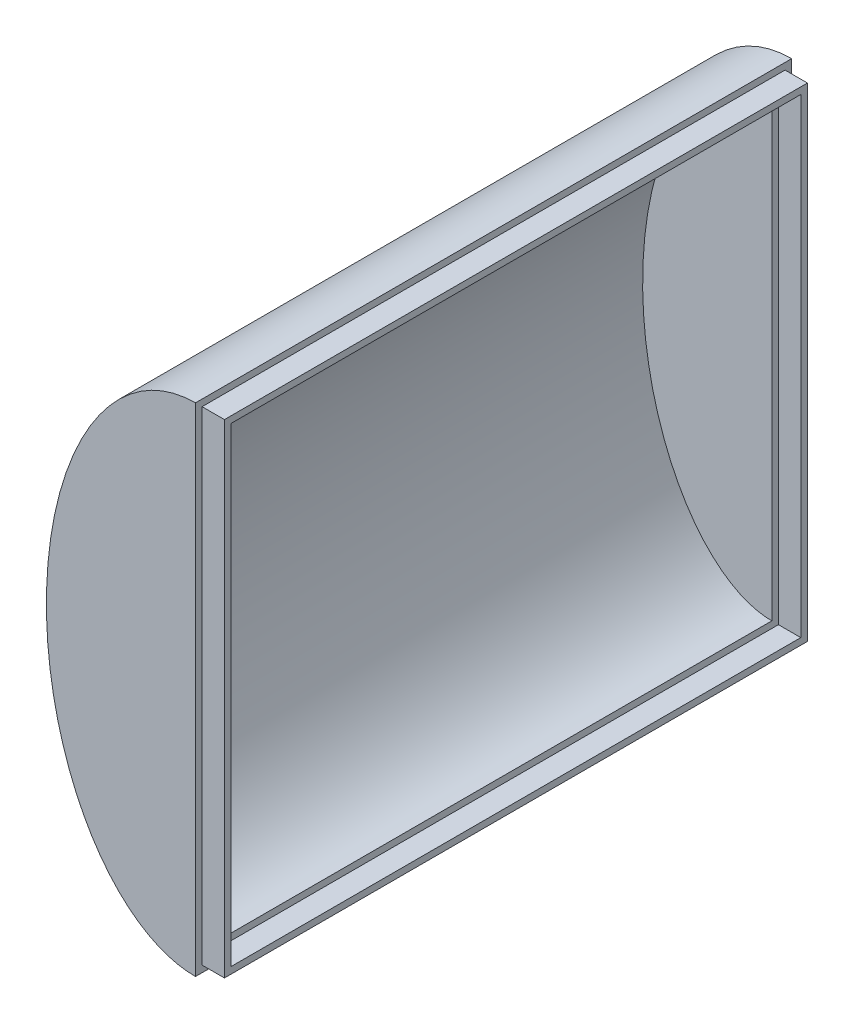
ISO-10303-21;
HEADER;
FILE_DESCRIPTION(('STEP AP214'),'2;1');
FILE_NAME('part.step','',(''),(''),'','','');
FILE_SCHEMA(('AUTOMOTIVE_DESIGN { 1 0 10303 214 1 1 1 1 }'));
ENDSEC;
DATA;
#1=APPLICATION_CONTEXT('core data for automotive mechanical design processes');
#2=APPLICATION_PROTOCOL_DEFINITION('international standard','automotive_design',2000,#1);
#3=PRODUCT_CONTEXT('',#1,'mechanical');
#4=PRODUCT('Part','Part','',(#3));
#5=PRODUCT_RELATED_PRODUCT_CATEGORY('part','',(#4));
#6=PRODUCT_DEFINITION_FORMATION('','',#4);
#7=PRODUCT_DEFINITION_CONTEXT('part definition',#1,'design');
#8=PRODUCT_DEFINITION('design','',#6,#7);
#9=PRODUCT_DEFINITION_SHAPE('','',#8);
#10=(LENGTH_UNIT() NAMED_UNIT(*) SI_UNIT(.MILLI.,.METRE.));
#11=(NAMED_UNIT(*) PLANE_ANGLE_UNIT() SI_UNIT($,.RADIAN.));
#12=(NAMED_UNIT(*) SI_UNIT($,.STERADIAN.) SOLID_ANGLE_UNIT());
#13=UNCERTAINTY_MEASURE_WITH_UNIT(LENGTH_MEASURE(1.E-05),#10,'distance_accuracy_value','');
#14=(GEOMETRIC_REPRESENTATION_CONTEXT(3) GLOBAL_UNCERTAINTY_ASSIGNED_CONTEXT((#13)) GLOBAL_UNIT_ASSIGNED_CONTEXT((#10,
#11,#12)) REPRESENTATION_CONTEXT('',''));
#15=CARTESIAN_POINT('',(0.,0.,0.));
#16=DIRECTION('',(0.,0.,1.));
#17=DIRECTION('',(1.,0.,0.));
#18=AXIS2_PLACEMENT_3D('',#15,#16,#17);
#19=CARTESIAN_POINT('',(0.,0.,0.));
#20=DIRECTION('',(1.,0.,0.));
#21=DIRECTION('',(0.,0.,-1.));
#22=AXIS2_PLACEMENT_3D('',#19,#20,#21);
#23=PLANE('',#22);
#24=DIRECTION('',(0.,1.,0.));
#25=VECTOR('',#24,1.);
#26=CARTESIAN_POINT('',(0.,0.,60.));
#27=LINE('',#26,#25);
#28=CARTESIAN_POINT('',(0.,-50.,60.));
#29=VERTEX_POINT('',#28);
#30=CARTESIAN_POINT('',(0.,50.,60.));
#31=VERTEX_POINT('',#30);
#32=EDGE_CURVE('E238',#29,#31,#27,.T.);
#33=ORIENTED_EDGE('',*,*,#32,.F.);
#34=DIRECTION('',(0.,0.,-1.));
#35=VECTOR('',#34,1.);
#36=CARTESIAN_POINT('',(0.,-50.,60.));
#37=LINE('',#36,#35);
#38=CARTESIAN_POINT('',(0.,-50.,-60.));
#39=VERTEX_POINT('',#38);
#40=EDGE_CURVE('E244',#29,#39,#37,.T.);
#41=ORIENTED_EDGE('',*,*,#40,.T.);
#42=DIRECTION('',(0.,1.,0.));
#43=VECTOR('',#42,1.);
#44=CARTESIAN_POINT('',(0.,0.,-60.));
#45=LINE('',#44,#43);
#46=CARTESIAN_POINT('',(0.,50.,-60.));
#47=VERTEX_POINT('',#46);
#48=EDGE_CURVE('E246',#39,#47,#45,.T.);
#49=ORIENTED_EDGE('',*,*,#48,.T.);
#50=DIRECTION('',(0.,0.,-1.));
#51=VECTOR('',#50,1.);
#52=CARTESIAN_POINT('',(0.,50.,60.));
#53=LINE('',#52,#51);
#54=EDGE_CURVE('E241',#47,#31,#53,.F.);
#55=ORIENTED_EDGE('',*,*,#54,.T.);
#56=EDGE_LOOP('',(#33,#41,#49,#55));
#57=FACE_BOUND('',#56,.T.);
#58=DIRECTION('',(0.,0.,-1.));
#59=VECTOR('',#58,1.);
#60=CARTESIAN_POINT('',(0.,-48.6666666666667,58.6666666666667));
#61=LINE('',#60,#59);
#62=CARTESIAN_POINT('',(0.,-48.6666666666667,58.6666666666667));
#63=VERTEX_POINT('',#62);
#64=CARTESIAN_POINT('',(0.,-48.6666666666667,-58.6666666666667));
#65=VERTEX_POINT('',#64);
#66=EDGE_CURVE('E176',#63,#65,#61,.T.);
#67=ORIENTED_EDGE('',*,*,#66,.F.);
#68=DIRECTION('',(0.,-1.,0.));
#69=VECTOR('',#68,1.);
#70=CARTESIAN_POINT('',(0.,48.6666666666667,58.6666666666667));
#71=LINE('',#70,#69);
#72=CARTESIAN_POINT('',(0.,48.6666666666667,58.6666666666667));
#73=VERTEX_POINT('',#72);
#74=EDGE_CURVE('E141',#73,#63,#71,.T.);
#75=ORIENTED_EDGE('',*,*,#74,.F.);
#76=DIRECTION('',(0.,0.,1.));
#77=VECTOR('',#76,1.);
#78=CARTESIAN_POINT('',(0.,48.6666666666667,-58.6666666666667));
#79=LINE('',#78,#77);
#80=CARTESIAN_POINT('',(0.,48.6666666666667,-58.6666666666667));
#81=VERTEX_POINT('',#80);
#82=EDGE_CURVE('E167',#81,#73,#79,.T.);
#83=ORIENTED_EDGE('',*,*,#82,.F.);
#84=DIRECTION('',(0.,1.,0.));
#85=VECTOR('',#84,1.);
#86=CARTESIAN_POINT('',(0.,-48.6666666666667,-58.6666666666667));
#87=LINE('',#86,#85);
#88=EDGE_CURVE('E178',#65,#81,#87,.T.);
#89=ORIENTED_EDGE('',*,*,#88,.F.);
#90=EDGE_LOOP('',(#67,#75,#83,#89));
#91=FACE_BOUND('',#90,.T.);
#92=ADVANCED_FACE('F34',(#57,#91),#23,.T.);
#93=CARTESIAN_POINT('',(0.,0.,60.));
#94=DIRECTION('',(0.,0.,1.));
#95=DIRECTION('',(0.,-1.,0.));
#96=AXIS2_PLACEMENT_3D('',#93,#94,#95);
#97=ELLIPSE('',#96,50.,30.);
#98=DIRECTION('',(0.,0.,-1.));
#99=VECTOR('',#98,1.);
#100=SURFACE_OF_LINEAR_EXTRUSION('',#97,#99);
#101=ORIENTED_EDGE('',*,*,#54,.F.);
#102=CARTESIAN_POINT('',(0.,0.,-60.));
#103=DIRECTION('',(0.,0.,1.));
#104=DIRECTION('',(0.,-1.,0.));
#105=AXIS2_PLACEMENT_3D('',#102,#103,#104);
#106=ELLIPSE('',#105,50.,30.);
#107=EDGE_CURVE('E11',#47,#39,#106,.T.);
#108=ORIENTED_EDGE('',*,*,#107,.T.);
#109=ORIENTED_EDGE('',*,*,#40,.F.);
#110=EDGE_CURVE('E42',#31,#29,#97,.T.);
#111=ORIENTED_EDGE('',*,*,#110,.F.);
#112=EDGE_LOOP('',(#101,#108,#109,#111));
#113=FACE_BOUND('',#112,.T.);
#114=ADVANCED_FACE('F229',(#113),#100,.F.);
#115=CARTESIAN_POINT('',(0.,0.,60.));
#116=DIRECTION('',(0.,0.,1.));
#117=DIRECTION('',(1.,0.,0.));
#118=AXIS2_PLACEMENT_3D('',#115,#116,#117);
#119=PLANE('',#118);
#120=ORIENTED_EDGE('',*,*,#110,.T.);
#121=ORIENTED_EDGE('',*,*,#32,.T.);
#122=EDGE_LOOP('',(#120,#121));
#123=FACE_BOUND('',#122,.T.);
#124=ADVANCED_FACE('F36',(#123),#119,.T.);
#125=CARTESIAN_POINT('',(0.,0.,-60.));
#126=DIRECTION('',(0.,0.,1.));
#127=DIRECTION('',(1.,0.,0.));
#128=AXIS2_PLACEMENT_3D('',#125,#126,#127);
#129=PLANE('',#128);
#130=ORIENTED_EDGE('',*,*,#48,.F.);
#131=ORIENTED_EDGE('',*,*,#107,.F.);
#132=EDGE_LOOP('',(#130,#131));
#133=FACE_BOUND('',#132,.T.);
#134=ADVANCED_FACE('F233',(#133),#129,.F.);
#135=CARTESIAN_POINT('',(4.5,0.,0.));
#136=DIRECTION('',(1.,0.,0.));
#137=DIRECTION('',(0.,0.,-1.));
#138=AXIS2_PLACEMENT_3D('',#135,#136,#137);
#139=PLANE('',#138);
#140=DIRECTION('',(0.,-1.,0.));
#141=VECTOR('',#140,1.);
#142=CARTESIAN_POINT('',(4.5,48.6666666666667,58.6666666666667));
#143=LINE('',#142,#141);
#144=CARTESIAN_POINT('',(4.5,48.6666666666667,58.6666666666667));
#145=VERTEX_POINT('',#144);
#146=CARTESIAN_POINT('',(4.5,-48.6666666666667,58.6666666666667));
#147=VERTEX_POINT('',#146);
#148=EDGE_CURVE('E163',#145,#147,#143,.T.);
#149=ORIENTED_EDGE('',*,*,#148,.T.);
#150=DIRECTION('',(0.,0.,-1.));
#151=VECTOR('',#150,1.);
#152=CARTESIAN_POINT('',(4.5,-48.6666666666667,58.6666666666667));
#153=LINE('',#152,#151);
#154=CARTESIAN_POINT('',(4.5,-48.6666666666667,-58.6666666666667));
#155=VERTEX_POINT('',#154);
#156=EDGE_CURVE('E166',#147,#155,#153,.T.);
#157=ORIENTED_EDGE('',*,*,#156,.T.);
#158=DIRECTION('',(0.,1.,0.));
#159=VECTOR('',#158,1.);
#160=CARTESIAN_POINT('',(4.5,-48.6666666666667,-58.6666666666667));
#161=LINE('',#160,#159);
#162=CARTESIAN_POINT('',(4.5,48.6666666666667,-58.6666666666667));
#163=VERTEX_POINT('',#162);
#164=EDGE_CURVE('E169',#155,#163,#161,.T.);
#165=ORIENTED_EDGE('',*,*,#164,.T.);
#166=DIRECTION('',(0.,0.,1.));
#167=VECTOR('',#166,1.);
#168=CARTESIAN_POINT('',(4.5,48.6666666666667,-58.6666666666667));
#169=LINE('',#168,#167);
#170=EDGE_CURVE('E171',#163,#145,#169,.T.);
#171=ORIENTED_EDGE('',*,*,#170,.T.);
#172=EDGE_LOOP('',(#149,#157,#165,#171));
#173=FACE_BOUND('',#172,.T.);
#174=DIRECTION('',(0.,0.,-1.));
#175=VECTOR('',#174,1.);
#176=CARTESIAN_POINT('',(4.5,-47.3333333333333,57.3333333333333));
#177=LINE('',#176,#175);
#178=CARTESIAN_POINT('',(4.5,-47.3333333333333,57.3333333333333));
#179=VERTEX_POINT('',#178);
#180=CARTESIAN_POINT('',(4.5,-47.3333333333333,-57.3333333333333));
#181=VERTEX_POINT('',#180);
#182=EDGE_CURVE('E133',#179,#181,#177,.T.);
#183=ORIENTED_EDGE('',*,*,#182,.F.);
#184=DIRECTION('',(0.,-1.,0.));
#185=VECTOR('',#184,1.);
#186=CARTESIAN_POINT('',(4.5,47.3333333333333,57.3333333333333));
#187=LINE('',#186,#185);
#188=CARTESIAN_POINT('',(4.5,47.3333333333333,57.3333333333333));
#189=VERTEX_POINT('',#188);
#190=EDGE_CURVE('E124',#189,#179,#187,.T.);
#191=ORIENTED_EDGE('',*,*,#190,.F.);
#192=DIRECTION('',(0.,0.,1.));
#193=VECTOR('',#192,1.);
#194=CARTESIAN_POINT('',(4.5,47.3333333333333,-57.3333333333333));
#195=LINE('',#194,#193);
#196=CARTESIAN_POINT('',(4.5,47.3333333333333,-57.3333333333333));
#197=VERTEX_POINT('',#196);
#198=EDGE_CURVE('E149',#197,#189,#195,.T.);
#199=ORIENTED_EDGE('',*,*,#198,.F.);
#200=DIRECTION('',(0.,1.,0.));
#201=VECTOR('',#200,1.);
#202=CARTESIAN_POINT('',(4.5,-47.3333333333333,-57.3333333333333));
#203=LINE('',#202,#201);
#204=EDGE_CURVE('E147',#181,#197,#203,.T.);
#205=ORIENTED_EDGE('',*,*,#204,.F.);
#206=EDGE_LOOP('',(#183,#191,#199,#205));
#207=FACE_BOUND('',#206,.T.);
#208=ADVANCED_FACE('F145',(#173,#207),#139,.T.);
#209=CARTESIAN_POINT('',(4.5,48.6666666666667,58.6666666666667));
#210=DIRECTION('',(0.,0.,-1.));
#211=DIRECTION('',(-1.,0.,0.));
#212=AXIS2_PLACEMENT_3D('',#209,#210,#211);
#213=PLANE('',#212);
#214=ORIENTED_EDGE('',*,*,#74,.T.);
#215=DIRECTION('',(-1.,0.,0.));
#216=VECTOR('',#215,1.);
#217=CARTESIAN_POINT('',(4.5,-48.6666666666667,58.6666666666667));
#218=LINE('',#217,#216);
#219=EDGE_CURVE('E187',#147,#63,#218,.T.);
#220=ORIENTED_EDGE('',*,*,#219,.F.);
#221=ORIENTED_EDGE('',*,*,#148,.F.);
#222=DIRECTION('',(-1.,0.,0.));
#223=VECTOR('',#222,1.);
#224=CARTESIAN_POINT('',(4.5,48.6666666666667,58.6666666666667));
#225=LINE('',#224,#223);
#226=EDGE_CURVE('E173',#145,#73,#225,.T.);
#227=ORIENTED_EDGE('',*,*,#226,.T.);
#228=EDGE_LOOP('',(#214,#220,#221,#227));
#229=FACE_BOUND('',#228,.T.);
#230=ADVANCED_FACE('F202',(#229),#213,.F.);
#231=CARTESIAN_POINT('',(4.5,-48.6666666666667,58.6666666666667));
#232=DIRECTION('',(0.,1.,0.));
#233=DIRECTION('',(0.,0.,1.));
#234=AXIS2_PLACEMENT_3D('',#231,#232,#233);
#235=PLANE('',#234);
#236=ORIENTED_EDGE('',*,*,#66,.T.);
#237=DIRECTION('',(-1.,0.,0.));
#238=VECTOR('',#237,1.);
#239=CARTESIAN_POINT('',(4.5,-48.6666666666667,-58.6666666666667));
#240=LINE('',#239,#238);
#241=EDGE_CURVE('E184',#155,#65,#240,.T.);
#242=ORIENTED_EDGE('',*,*,#241,.F.);
#243=ORIENTED_EDGE('',*,*,#156,.F.);
#244=ORIENTED_EDGE('',*,*,#219,.T.);
#245=EDGE_LOOP('',(#236,#242,#243,#244));
#246=FACE_BOUND('',#245,.T.);
#247=ADVANCED_FACE('F279',(#246),#235,.F.);
#248=CARTESIAN_POINT('',(4.5,-48.6666666666667,-58.6666666666667));
#249=DIRECTION('',(0.,0.,1.));
#250=DIRECTION('',(1.,0.,0.));
#251=AXIS2_PLACEMENT_3D('',#248,#249,#250);
#252=PLANE('',#251);
#253=ORIENTED_EDGE('',*,*,#88,.T.);
#254=DIRECTION('',(-1.,0.,0.));
#255=VECTOR('',#254,1.);
#256=CARTESIAN_POINT('',(4.5,48.6666666666667,-58.6666666666667));
#257=LINE('',#256,#255);
#258=EDGE_CURVE('E49',#163,#81,#257,.T.);
#259=ORIENTED_EDGE('',*,*,#258,.F.);
#260=ORIENTED_EDGE('',*,*,#164,.F.);
#261=ORIENTED_EDGE('',*,*,#241,.T.);
#262=EDGE_LOOP('',(#253,#259,#260,#261));
#263=FACE_BOUND('',#262,.T.);
#264=ADVANCED_FACE('F283',(#263),#252,.F.);
#265=CARTESIAN_POINT('',(4.5,48.6666666666667,-58.6666666666667));
#266=DIRECTION('',(0.,-1.,0.));
#267=DIRECTION('',(0.,0.,-1.));
#268=AXIS2_PLACEMENT_3D('',#265,#266,#267);
#269=PLANE('',#268);
#270=ORIENTED_EDGE('',*,*,#82,.T.);
#271=ORIENTED_EDGE('',*,*,#226,.F.);
#272=ORIENTED_EDGE('',*,*,#170,.F.);
#273=ORIENTED_EDGE('',*,*,#258,.T.);
#274=EDGE_LOOP('',(#270,#271,#272,#273));
#275=FACE_BOUND('',#274,.T.);
#276=ADVANCED_FACE('F288',(#275),#269,.F.);
#277=CARTESIAN_POINT('',(4.5,47.3333333333333,57.3333333333333));
#278=DIRECTION('',(0.,0.,-1.));
#279=DIRECTION('',(-1.,0.,0.));
#280=AXIS2_PLACEMENT_3D('',#277,#278,#279);
#281=PLANE('',#280);
#282=DIRECTION('',(0.,-1.,0.));
#283=VECTOR('',#282,1.);
#284=CARTESIAN_POINT('',(0.,47.3333333333333,57.3333333333333));
#285=LINE('',#284,#283);
#286=CARTESIAN_POINT('',(0.,47.3333333333333,57.3333333333333));
#287=VERTEX_POINT('',#286);
#288=CARTESIAN_POINT('',(0.,-47.3333333333333,57.3333333333333));
#289=VERTEX_POINT('',#288);
#290=EDGE_CURVE('E57',#287,#289,#285,.T.);
#291=ORIENTED_EDGE('',*,*,#290,.F.);
#292=DIRECTION('',(-1.,0.,0.));
#293=VECTOR('',#292,1.);
#294=CARTESIAN_POINT('',(4.5,47.3333333333333,57.3333333333333));
#295=LINE('',#294,#293);
#296=EDGE_CURVE('E129',#189,#287,#295,.T.);
#297=ORIENTED_EDGE('',*,*,#296,.F.);
#298=ORIENTED_EDGE('',*,*,#190,.T.);
#299=DIRECTION('',(-1.,0.,0.));
#300=VECTOR('',#299,1.);
#301=CARTESIAN_POINT('',(4.5,-47.3333333333333,57.3333333333333));
#302=LINE('',#301,#300);
#303=EDGE_CURVE('E127',#179,#289,#302,.T.);
#304=ORIENTED_EDGE('',*,*,#303,.T.);
#305=EDGE_LOOP('',(#291,#297,#298,#304));
#306=FACE_BOUND('',#305,.T.);
#307=ADVANCED_FACE('F126',(#306),#281,.T.);
#308=CARTESIAN_POINT('',(4.5,-47.3333333333333,57.3333333333333));
#309=DIRECTION('',(0.,1.,0.));
#310=DIRECTION('',(0.,0.,1.));
#311=AXIS2_PLACEMENT_3D('',#308,#309,#310);
#312=PLANE('',#311);
#313=DIRECTION('',(0.,0.,-1.));
#314=VECTOR('',#313,1.);
#315=CARTESIAN_POINT('',(0.,-47.3333333333333,57.3333333333333));
#316=LINE('',#315,#314);
#317=CARTESIAN_POINT('',(0.,-47.3333333333333,-57.3333333333333));
#318=VERTEX_POINT('',#317);
#319=EDGE_CURVE('E140',#289,#318,#316,.T.);
#320=ORIENTED_EDGE('',*,*,#319,.F.);
#321=ORIENTED_EDGE('',*,*,#303,.F.);
#322=ORIENTED_EDGE('',*,*,#182,.T.);
#323=DIRECTION('',(-1.,0.,0.));
#324=VECTOR('',#323,1.);
#325=CARTESIAN_POINT('',(4.5,-47.3333333333333,-57.3333333333333));
#326=LINE('',#325,#324);
#327=EDGE_CURVE('E142',#181,#318,#326,.T.);
#328=ORIENTED_EDGE('',*,*,#327,.T.);
#329=EDGE_LOOP('',(#320,#321,#322,#328));
#330=FACE_BOUND('',#329,.T.);
#331=ADVANCED_FACE('F137',(#330),#312,.T.);
#332=CARTESIAN_POINT('',(4.5,-47.3333333333333,-57.3333333333333));
#333=DIRECTION('',(0.,0.,1.));
#334=DIRECTION('',(0.,-1.,0.));
#335=AXIS2_PLACEMENT_3D('',#332,#333,#334);
#336=PLANE('',#335);
#337=DIRECTION('',(0.,1.,0.));
#338=VECTOR('',#337,1.);
#339=CARTESIAN_POINT('',(0.,-47.3333333333333,-57.3333333333333));
#340=LINE('',#339,#338);
#341=CARTESIAN_POINT('',(0.,47.3333333333333,-57.3333333333333));
#342=VERTEX_POINT('',#341);
#343=EDGE_CURVE('E155',#318,#342,#340,.T.);
#344=ORIENTED_EDGE('',*,*,#343,.F.);
#345=ORIENTED_EDGE('',*,*,#327,.F.);
#346=ORIENTED_EDGE('',*,*,#204,.T.);
#347=DIRECTION('',(-1.,0.,0.));
#348=VECTOR('',#347,1.);
#349=CARTESIAN_POINT('',(4.5,47.3333333333333,-57.3333333333333));
#350=LINE('',#349,#348);
#351=EDGE_CURVE('E159',#197,#342,#350,.T.);
#352=ORIENTED_EDGE('',*,*,#351,.T.);
#353=EDGE_LOOP('',(#344,#345,#346,#352));
#354=FACE_BOUND('',#353,.T.);
#355=ADVANCED_FACE('F265',(#354),#336,.T.);
#356=CARTESIAN_POINT('',(4.5,47.3333333333333,-57.3333333333333));
#357=DIRECTION('',(0.,-1.,0.));
#358=DIRECTION('',(0.,0.,-1.));
#359=AXIS2_PLACEMENT_3D('',#356,#357,#358);
#360=PLANE('',#359);
#361=DIRECTION('',(0.,0.,1.));
#362=VECTOR('',#361,1.);
#363=CARTESIAN_POINT('',(0.,47.3333333333333,-57.3333333333333));
#364=LINE('',#363,#362);
#365=EDGE_CURVE('E134',#342,#287,#364,.T.);
#366=ORIENTED_EDGE('',*,*,#365,.F.);
#367=ORIENTED_EDGE('',*,*,#351,.F.);
#368=ORIENTED_EDGE('',*,*,#198,.T.);
#369=ORIENTED_EDGE('',*,*,#296,.T.);
#370=EDGE_LOOP('',(#366,#367,#368,#369));
#371=FACE_BOUND('',#370,.T.);
#372=ADVANCED_FACE('F261',(#371),#360,.T.);
#373=CARTESIAN_POINT('',(0.,0.,-56.));
#374=DIRECTION('',(0.,0.,1.));
#375=DIRECTION('',(1.,0.,0.));
#376=AXIS2_PLACEMENT_3D('',#373,#374,#375);
#377=PLANE('',#376);
#378=DIRECTION('',(0.,1.,0.));
#379=VECTOR('',#378,1.);
#380=CARTESIAN_POINT('',(0.,0.,-56.));
#381=LINE('',#380,#379);
#382=CARTESIAN_POINT('',(0.,-46.,-56.));
#383=VERTEX_POINT('',#382);
#384=CARTESIAN_POINT('',(0.,46.,-56.));
#385=VERTEX_POINT('',#384);
#386=EDGE_CURVE('E189',#383,#385,#381,.T.);
#387=ORIENTED_EDGE('',*,*,#386,.T.);
#388=CARTESIAN_POINT('',(0.,46.,-56.));
#389=CARTESIAN_POINT('',(-0.290096940892015,46.0000415370607,-56.));
#390=CARTESIAN_POINT('',(-0.580179080322474,45.9909847599539,-56.));
#391=CARTESIAN_POINT('',(-1.15889094098684,45.9549995012108,-56.));
#392=CARTESIAN_POINT('',(-1.4475219734639,45.9280921511117,-56.));
#393=CARTESIAN_POINT('',(-2.02248361541568,45.8567436921062,-56.));
#394=CARTESIAN_POINT('',(-2.30881510526618,45.8123096552161,-56.));
#395=CARTESIAN_POINT('',(-2.87517054596245,45.7070617482515,-56.));
#396=CARTESIAN_POINT('',(-3.15522923354983,45.6464340619222,-56.));
#397=CARTESIAN_POINT('',(-3.71149547858113,45.5092570253822,-56.));
#398=CARTESIAN_POINT('',(-3.98770198352222,45.4327034113883,-56.));
#399=CARTESIAN_POINT('',(-4.53548687756831,45.2644997691697,-56.));
#400=CARTESIAN_POINT('',(-4.80706457586155,45.1728475089908,-56.));
#401=CARTESIAN_POINT('',(-5.57083375545855,44.8923759453218,-56.));
#402=CARTESIAN_POINT('',(-6.05688399864488,44.6865655727755,-56.));
#403=CARTESIAN_POINT('',(-7.00854942518279,44.2326339895169,-56.));
#404=CARTESIAN_POINT('',(-7.47416045575506,43.9845042300476,-56.));
#405=CARTESIAN_POINT('',(-8.84233961855387,43.18266510511,-56.));
#406=CARTESIAN_POINT('',(-9.71261591924279,42.5729130011616,-56.));
#407=CARTESIAN_POINT('',(-10.9540877087984,41.57380934339,-56.));
#408=CARTESIAN_POINT('',(-11.3592000349385,41.2246463374684,-56.));
#409=CARTESIAN_POINT('',(-12.1476396680034,40.5019921586814,-56.));
#410=CARTESIAN_POINT('',(-12.5309571676756,40.1284901934659,-56.));
#411=CARTESIAN_POINT('',(-13.2761860363545,39.36074737813,-56.));
#412=CARTESIAN_POINT('',(-13.6380943712582,38.9665036033712,-56.));
#413=CARTESIAN_POINT('',(-14.3417276291129,38.1596593023502,-56.));
#414=CARTESIAN_POINT('',(-14.6834296289182,37.7470388245009,-56.));
#415=CARTESIAN_POINT('',(-15.3470007103739,36.9063302030189,-56.));
#416=CARTESIAN_POINT('',(-15.6688740464441,36.4782454088856,-56.));
#417=CARTESIAN_POINT('',(-16.2937407377975,35.6085106750182,-56.));
#418=CARTESIAN_POINT('',(-16.5967325982124,35.166859665353,-56.));
#419=CARTESIAN_POINT('',(-17.3843063732534,33.9677432975604,-56.));
#420=CARTESIAN_POINT('',(-17.8524935064598,33.199462626661,-56.));
#421=CARTESIAN_POINT('',(-18.7417338249272,31.6357332608866,-56.));
#422=CARTESIAN_POINT('',(-19.1627601887497,30.8402694385439,-56.));
#423=CARTESIAN_POINT('',(-19.9606524371181,29.2273709088711,-56.));
#424=CARTESIAN_POINT('',(-20.3375097294695,28.4099319646234,-56.));
#425=CARTESIAN_POINT('',(-21.0501624860939,26.7560860868235,-56.));
#426=CARTESIAN_POINT('',(-21.3859006941192,25.9196545845021,-56.));
#427=CARTESIAN_POINT('',(-22.0179534764834,24.2323257033912,-56.));
#428=CARTESIAN_POINT('',(-22.3142787150458,23.3814323082122,-56.));
#429=CARTESIAN_POINT('',(-22.869577457273,21.6675350784762,-56.));
#430=CARTESIAN_POINT('',(-23.1285480532739,20.8045303069076,-56.));
#431=CARTESIAN_POINT('',(-23.7387184883877,18.6080880418961,-56.));
#432=CARTESIAN_POINT('',(-24.0659692060804,17.2679484074003,-56.));
#433=CARTESIAN_POINT('',(-24.6415827437467,14.5704103435523,-56.));
#434=CARTESIAN_POINT('',(-24.8899112895997,13.213004681362,-56.));
#435=CARTESIAN_POINT('',(-25.3108973618477,10.4862578907024,-56.));
#436=CARTESIAN_POINT('',(-25.4835389127275,9.11691430460164,-56.));
#437=CARTESIAN_POINT('',(-25.7557125280827,6.3669786690307,-56.));
#438=CARTESIAN_POINT('',(-25.855029254319,4.98636543269938,-56.));
#439=CARTESIAN_POINT('',(-25.9809785620621,2.22217583048596,-56.));
#440=CARTESIAN_POINT('',(-26.0076286843962,0.838600260390252,-56.));
#441=CARTESIAN_POINT('',(-25.9886318343981,-1.92792204629865,-56.));
#442=CARTESIAN_POINT('',(-25.9429915802486,-3.31086882938,-56.));
#443=CARTESIAN_POINT('',(-25.7768212873758,-6.10660264760042,-56.));
#444=CARTESIAN_POINT('',(-25.6544682556832,-7.51928245316948,-56.));
#445=CARTESIAN_POINT('',(-25.3315919436524,-10.3359092763767,-56.));
#446=CARTESIAN_POINT('',(-25.131056999917,-11.7398549592702,-56.));
#447=CARTESIAN_POINT('',(-24.6488678170361,-14.5348346043138,-56.));
#448=CARTESIAN_POINT('',(-24.3671639762042,-15.9258601329009,-56.));
#449=CARTESIAN_POINT('',(-23.8817189224367,-17.9932983876215,-56.));
#450=CARTESIAN_POINT('',(-23.7099978120112,-18.6773470331039,-56.));
#451=CARTESIAN_POINT('',(-23.3448587283388,-20.0396137102019,-56.));
#452=CARTESIAN_POINT('',(-23.15144218434,-20.7178321227351,-56.));
#453=CARTESIAN_POINT('',(-22.7422698392365,-22.067153303985,-56.));
#454=CARTESIAN_POINT('',(-22.5265246141933,-22.7382592769811,-56.));
#455=CARTESIAN_POINT('',(-22.0717572364026,-24.0725772350678,-56.));
#456=CARTESIAN_POINT('',(-21.8327343869992,-24.735788983232,-56.));
#457=CARTESIAN_POINT('',(-21.3307376443266,-26.0522066593041,-56.));
#458=CARTESIAN_POINT('',(-21.0677923939882,-26.7054234871075,-56.));
#459=CARTESIAN_POINT('',(-20.51663047064,-28.001048650449,-56.));
#460=CARTESIAN_POINT('',(-20.2284164755082,-28.643458122727,-56.));
#461=CARTESIAN_POINT('',(-19.6159913983009,-29.9356472223655,-56.));
#462=CARTESIAN_POINT('',(-19.2909357554394,-30.5850277848609,-56.));
#463=CARTESIAN_POINT('',(-18.6110611446119,-31.8679627550308,-56.));
#464=CARTESIAN_POINT('',(-18.2562458879812,-32.5015191233963,-56.));
#465=CARTESIAN_POINT('',(-17.5146984615133,-33.7505860499242,-56.));
#466=CARTESIAN_POINT('',(-17.1279344620126,-34.3660777630719,-56.));
#467=CARTESIAN_POINT('',(-16.3208208955759,-35.5747846886408,-56.));
#468=CARTESIAN_POINT('',(-15.9004707988499,-36.1679995494479,-56.));
#469=CARTESIAN_POINT('',(-15.1677033279798,-37.137579619907,-56.));
#470=CARTESIAN_POINT('',(-14.8650309704455,-37.5213290793362,-56.));
#471=CARTESIAN_POINT('',(-14.2428860251051,-38.2750284167724,-56.));
#472=CARTESIAN_POINT('',(-13.9234128903294,-38.6449778448316,-56.));
#473=CARTESIAN_POINT('',(-13.2669493565658,-39.3691997847232,-56.));
#474=CARTESIAN_POINT('',(-12.9299545929916,-39.7234683494185,-56.));
#475=CARTESIAN_POINT('',(-12.2383773254898,-40.4134791988583,-56.));
#476=CARTESIAN_POINT('',(-11.8838196810401,-40.7492463246119,-56.));
#477=CARTESIAN_POINT('',(-11.1562339154333,-41.4000645908269,-56.));
#478=CARTESIAN_POINT('',(-10.783209166091,-41.7151194887524,-56.));
#479=CARTESIAN_POINT('',(-10.0184607500407,-42.3213431315717,-56.));
#480=CARTESIAN_POINT('',(-9.62674667265599,-42.6125239219261,-56.));
#481=CARTESIAN_POINT('',(-8.84662008098985,-43.1522333808237,-56.));
#482=CARTESIAN_POINT('',(-8.45922703864319,-43.4022313341339,-56.));
#483=CARTESIAN_POINT('',(-7.667702087994,-43.8746010849258,-56.));
#484=CARTESIAN_POINT('',(-7.26356502953012,-44.0969642970673,-56.));
#485=CARTESIAN_POINT('',(-6.44072356124639,-44.5096519747811,-56.));
#486=CARTESIAN_POINT('',(-6.02206694687506,-44.7000713789135,-56.));
#487=CARTESIAN_POINT('',(-5.17066719957023,-45.0457636826147,-56.));
#488=CARTESIAN_POINT('',(-4.73793404093047,-45.2010608740821,-56.));
#489=CARTESIAN_POINT('',(-4.06838048917275,-45.4085213598816,-56.));
#490=CARTESIAN_POINT('',(-3.83583152551206,-45.4746972106835,-56.));
#491=CARTESIAN_POINT('',(-3.36784112418413,-45.5958372107489,-56.));
#492=CARTESIAN_POINT('',(-3.13240005052925,-45.6508027559619,-56.));
#493=CARTESIAN_POINT('',(-2.65913750410585,-45.7490751951132,-56.));
#494=CARTESIAN_POINT('',(-2.42131643419728,-45.7923840286766,-56.));
#495=CARTESIAN_POINT('',(-1.94207935307007,-45.8672597391492,-56.));
#496=CARTESIAN_POINT('',(-1.70064979147988,-45.8987401484619,-56.));
#497=CARTESIAN_POINT('',(-1.21642937698892,-45.949233713013,-56.));
#498=CARTESIAN_POINT('',(-0.973638213090009,-45.9682438923873,-56.));
#499=CARTESIAN_POINT('',(-0.487233747430355,-45.9936417454796,-56.));
#500=CARTESIAN_POINT('',(-0.243620002400489,-46.0000209172368,-56.));
#501=CARTESIAN_POINT('',(0.,-46.,-56.));
#502=B_SPLINE_CURVE_WITH_KNOTS('',3,(#388,#389,#390,#391,#392,#393,#394,#395,#396,#397,#398,
#399,#400,#401,#402,#403,#404,#405,#406,#407,#408,#409,#410,#411,#412,#413,#414,#415,#416,#417,
#418,#419,#420,#421,#422,#423,#424,#425,#426,#427,#428,#429,#430,#431,#432,#433,#434,#435,#436,
#437,#438,#439,#440,#441,#442,#443,#444,#445,#446,#447,#448,#449,#450,#451,#452,#453,#454,#455,
#456,#457,#458,#459,#460,#461,#462,#463,#464,#465,#466,#467,#468,#469,#470,#471,#472,#473,#474,
#475,#476,#477,#478,#479,#480,#481,#482,#483,#484,#485,#486,#487,#488,#489,#490,#491,#492,#493,
#494,#495,#496,#497,#498,#499,#500,#501),.UNSPECIFIED.,.F.,.F.,(4,2,2,2,2,2,2,2,2,2,2,2,2,2,2,2,
2,2,2,2,2,2,2,2,2,2,2,2,2,2,2,2,2,2,2,2,2,2,2,2,2,2,2,2,2,2,2,2,2,2,2,2,2,2,2,2,4),(0.,
0.870125657479236,1.73922309247787,2.60797020489599,3.46712961710018,4.32651934522548,
5.18603622664422,6.76693249043969,8.34814848334307,11.5221389855318,13.125979329883,
14.7305357511033,16.3353190276631,17.9418892451266,19.5481135491041,21.1544648585944,
23.8515479792043,26.5501572888333,29.2492906897678,31.9521407679296,34.6542580241221,
37.3565854982059,41.4924173860936,45.6300429260157,49.7685413888596,53.9191458494458,
58.0687483162666,62.2179651694935,66.4697282284015,70.7221258201235,74.9771275505307,
77.0926569592189,79.2080470831809,81.3224397910235,83.4368957981533,85.5488526172557,
87.6605858897459,89.8384413916664,92.016025694906,94.195806254481,96.3756212048984,
97.8414450937598,99.3073167338582,100.773555284182,102.237774651884,103.701727654181,
105.164937428088,106.54708007697,107.929651051124,109.308037220417,110.685467108307,
111.410578497892,112.135599538665,112.860499864453,113.590600733945,114.32087576953,
115.051642188073),.UNSPECIFIED.);
#503=EDGE_CURVE('E192',#385,#383,#502,.T.);
#504=ORIENTED_EDGE('',*,*,#503,.T.);
#505=EDGE_LOOP('',(#387,#504));
#506=FACE_BOUND('',#505,.T.);
#507=ADVANCED_FACE('F210',(#506),#377,.T.);
#508=CARTESIAN_POINT('',(0.,0.,56.));
#509=DIRECTION('',(0.,0.,1.));
#510=DIRECTION('',(1.,0.,0.));
#511=AXIS2_PLACEMENT_3D('',#508,#509,#510);
#512=PLANE('',#511);
#513=CARTESIAN_POINT('',(0.,46.,56.));
#514=CARTESIAN_POINT('',(-0.290096940892015,46.0000415370607,56.));
#515=CARTESIAN_POINT('',(-0.580179080322474,45.9909847599539,56.));
#516=CARTESIAN_POINT('',(-1.15889094098684,45.9549995012108,56.));
#517=CARTESIAN_POINT('',(-1.4475219734639,45.9280921511117,56.));
#518=CARTESIAN_POINT('',(-2.02248361541568,45.8567436921062,56.));
#519=CARTESIAN_POINT('',(-2.30881510526618,45.8123096552161,56.));
#520=CARTESIAN_POINT('',(-2.87517054596245,45.7070617482515,56.));
#521=CARTESIAN_POINT('',(-3.15522923354983,45.6464340619222,56.));
#522=CARTESIAN_POINT('',(-3.71149547858113,45.5092570253822,56.));
#523=CARTESIAN_POINT('',(-3.98770198352222,45.4327034113883,56.));
#524=CARTESIAN_POINT('',(-4.53548687756831,45.2644997691697,56.));
#525=CARTESIAN_POINT('',(-4.80706457586155,45.1728475089908,56.));
#526=CARTESIAN_POINT('',(-5.57083375545855,44.8923759453218,56.));
#527=CARTESIAN_POINT('',(-6.05688399864488,44.6865655727755,56.));
#528=CARTESIAN_POINT('',(-7.00854942518279,44.2326339895169,56.));
#529=CARTESIAN_POINT('',(-7.47416045575506,43.9845042300476,56.));
#530=CARTESIAN_POINT('',(-8.84233961855387,43.18266510511,56.));
#531=CARTESIAN_POINT('',(-9.7126159192428,42.5729130011616,56.));
#532=CARTESIAN_POINT('',(-10.9540877087984,41.57380934339,56.));
#533=CARTESIAN_POINT('',(-11.3592000349385,41.2246463374684,56.));
#534=CARTESIAN_POINT('',(-12.1476396680034,40.5019921586814,56.));
#535=CARTESIAN_POINT('',(-12.5309571676756,40.1284901934659,56.));
#536=CARTESIAN_POINT('',(-13.2761860363545,39.36074737813,56.));
#537=CARTESIAN_POINT('',(-13.6380943712582,38.9665036033712,56.));
#538=CARTESIAN_POINT('',(-14.3417276291129,38.1596593023502,56.));
#539=CARTESIAN_POINT('',(-14.6834296289182,37.7470388245009,56.));
#540=CARTESIAN_POINT('',(-15.3470007103739,36.9063302030189,56.));
#541=CARTESIAN_POINT('',(-15.6688740464441,36.4782454088856,56.));
#542=CARTESIAN_POINT('',(-16.2937407377975,35.6085106750182,56.));
#543=CARTESIAN_POINT('',(-16.5967325982124,35.166859665353,56.));
#544=CARTESIAN_POINT('',(-17.3843063732534,33.9677432975604,56.));
#545=CARTESIAN_POINT('',(-17.8524935064598,33.199462626661,56.));
#546=CARTESIAN_POINT('',(-18.7417338249272,31.6357332608866,56.));
#547=CARTESIAN_POINT('',(-19.1627601887497,30.8402694385439,56.));
#548=CARTESIAN_POINT('',(-19.9606524371181,29.2273709088711,56.));
#549=CARTESIAN_POINT('',(-20.3375097294695,28.4099319646234,56.));
#550=CARTESIAN_POINT('',(-21.0501624860939,26.7560860868235,56.));
#551=CARTESIAN_POINT('',(-21.3859006941192,25.9196545845021,56.));
#552=CARTESIAN_POINT('',(-22.0179534764834,24.2323257033912,56.));
#553=CARTESIAN_POINT('',(-22.3142787150458,23.3814323082122,56.));
#554=CARTESIAN_POINT('',(-22.869577457273,21.6675350784762,56.));
#555=CARTESIAN_POINT('',(-23.1285480532739,20.8045303069076,56.));
#556=CARTESIAN_POINT('',(-23.7387184883877,18.6080880418961,56.));
#557=CARTESIAN_POINT('',(-24.0659692060804,17.2679484074003,56.));
#558=CARTESIAN_POINT('',(-24.6415827437467,14.5704103435523,56.));
#559=CARTESIAN_POINT('',(-24.8899112895997,13.213004681362,56.));
#560=CARTESIAN_POINT('',(-25.3108973618477,10.4862578907024,56.));
#561=CARTESIAN_POINT('',(-25.4835389127275,9.11691430460164,56.));
#562=CARTESIAN_POINT('',(-25.7557125280827,6.3669786690307,56.));
#563=CARTESIAN_POINT('',(-25.855029254319,4.98636543269938,56.));
#564=CARTESIAN_POINT('',(-25.9809785620621,2.22217583048596,56.));
#565=CARTESIAN_POINT('',(-26.0076286843962,0.838600260390252,56.));
#566=CARTESIAN_POINT('',(-25.9886318343981,-1.92792204629865,56.));
#567=CARTESIAN_POINT('',(-25.9429915802486,-3.31086882938,56.));
#568=CARTESIAN_POINT('',(-25.7768212873758,-6.10660264760042,56.));
#569=CARTESIAN_POINT('',(-25.6544682556832,-7.51928245316948,56.));
#570=CARTESIAN_POINT('',(-25.3315919436524,-10.3359092763767,56.));
#571=CARTESIAN_POINT('',(-25.131056999917,-11.7398549592702,56.));
#572=CARTESIAN_POINT('',(-24.6488678170361,-14.5348346043138,56.));
#573=CARTESIAN_POINT('',(-24.3671639762042,-15.9258601329009,56.));
#574=CARTESIAN_POINT('',(-23.8817189224367,-17.9932983876215,56.));
#575=CARTESIAN_POINT('',(-23.7099978120112,-18.6773470331039,56.));
#576=CARTESIAN_POINT('',(-23.3448587283388,-20.0396137102019,56.));
#577=CARTESIAN_POINT('',(-23.15144218434,-20.7178321227351,56.));
#578=CARTESIAN_POINT('',(-22.7422698392365,-22.067153303985,56.));
#579=CARTESIAN_POINT('',(-22.5265246141933,-22.7382592769811,56.));
#580=CARTESIAN_POINT('',(-22.0717572364026,-24.0725772350678,56.));
#581=CARTESIAN_POINT('',(-21.8327343869992,-24.735788983232,56.));
#582=CARTESIAN_POINT('',(-21.3307376443266,-26.0522066593041,56.));
#583=CARTESIAN_POINT('',(-21.0677923939882,-26.7054234871075,56.));
#584=CARTESIAN_POINT('',(-20.51663047064,-28.001048650449,56.));
#585=CARTESIAN_POINT('',(-20.2284164755082,-28.643458122727,56.));
#586=CARTESIAN_POINT('',(-19.6159913983009,-29.9356472223655,56.));
#587=CARTESIAN_POINT('',(-19.2909357554394,-30.5850277848609,56.));
#588=CARTESIAN_POINT('',(-18.6110611446119,-31.8679627550308,56.));
#589=CARTESIAN_POINT('',(-18.2562458879812,-32.5015191233963,56.));
#590=CARTESIAN_POINT('',(-17.5146984615133,-33.7505860499242,56.));
#591=CARTESIAN_POINT('',(-17.1279344620126,-34.3660777630719,56.));
#592=CARTESIAN_POINT('',(-16.3208208955759,-35.5747846886408,56.));
#593=CARTESIAN_POINT('',(-15.9004707988499,-36.1679995494479,56.));
#594=CARTESIAN_POINT('',(-15.1677033279798,-37.137579619907,56.));
#595=CARTESIAN_POINT('',(-14.8650309704455,-37.5213290793362,56.));
#596=CARTESIAN_POINT('',(-14.2428860251051,-38.2750284167724,56.));
#597=CARTESIAN_POINT('',(-13.9234128903294,-38.6449778448316,56.));
#598=CARTESIAN_POINT('',(-13.2669493565658,-39.3691997847232,56.));
#599=CARTESIAN_POINT('',(-12.9299545929916,-39.7234683494185,56.));
#600=CARTESIAN_POINT('',(-12.2383773254898,-40.4134791988583,56.));
#601=CARTESIAN_POINT('',(-11.8838196810401,-40.7492463246119,56.));
#602=CARTESIAN_POINT('',(-11.1562339154333,-41.4000645908269,56.));
#603=CARTESIAN_POINT('',(-10.783209166091,-41.7151194887524,56.));
#604=CARTESIAN_POINT('',(-10.0184607500407,-42.3213431315717,56.));
#605=CARTESIAN_POINT('',(-9.62674667265599,-42.6125239219261,56.));
#606=CARTESIAN_POINT('',(-8.84662008098985,-43.1522333808237,56.));
#607=CARTESIAN_POINT('',(-8.45922703864319,-43.4022313341339,56.));
#608=CARTESIAN_POINT('',(-7.667702087994,-43.8746010849258,56.));
#609=CARTESIAN_POINT('',(-7.26356502953012,-44.0969642970673,56.));
#610=CARTESIAN_POINT('',(-6.44072356124639,-44.5096519747811,56.));
#611=CARTESIAN_POINT('',(-6.02206694687506,-44.7000713789135,56.));
#612=CARTESIAN_POINT('',(-5.17066719957023,-45.0457636826147,56.));
#613=CARTESIAN_POINT('',(-4.73793404093047,-45.2010608740821,56.));
#614=CARTESIAN_POINT('',(-4.06838048917275,-45.4085213598816,56.));
#615=CARTESIAN_POINT('',(-3.83583152551206,-45.4746972106835,56.));
#616=CARTESIAN_POINT('',(-3.36784112418413,-45.5958372107489,56.));
#617=CARTESIAN_POINT('',(-3.13240005052925,-45.6508027559619,56.));
#618=CARTESIAN_POINT('',(-2.65913750410585,-45.7490751951132,56.));
#619=CARTESIAN_POINT('',(-2.42131643419728,-45.7923840286766,56.));
#620=CARTESIAN_POINT('',(-1.94207935307007,-45.8672597391492,56.));
#621=CARTESIAN_POINT('',(-1.70064979147988,-45.8987401484619,56.));
#622=CARTESIAN_POINT('',(-1.21642937698892,-45.949233713013,56.));
#623=CARTESIAN_POINT('',(-0.973638213090009,-45.9682438923873,56.));
#624=CARTESIAN_POINT('',(-0.487233747430355,-45.9936417454796,56.));
#625=CARTESIAN_POINT('',(-0.243620002400489,-46.0000209172368,56.));
#626=CARTESIAN_POINT('',(0.,-46.,56.));
#627=B_SPLINE_CURVE_WITH_KNOTS('',3,(#513,#514,#515,#516,#517,#518,#519,#520,#521,#522,#523,
#524,#525,#526,#527,#528,#529,#530,#531,#532,#533,#534,#535,#536,#537,#538,#539,#540,#541,#542,
#543,#544,#545,#546,#547,#548,#549,#550,#551,#552,#553,#554,#555,#556,#557,#558,#559,#560,#561,
#562,#563,#564,#565,#566,#567,#568,#569,#570,#571,#572,#573,#574,#575,#576,#577,#578,#579,#580,
#581,#582,#583,#584,#585,#586,#587,#588,#589,#590,#591,#592,#593,#594,#595,#596,#597,#598,#599,
#600,#601,#602,#603,#604,#605,#606,#607,#608,#609,#610,#611,#612,#613,#614,#615,#616,#617,#618,
#619,#620,#621,#622,#623,#624,#625,#626),.UNSPECIFIED.,.F.,.F.,(4,2,2,2,2,2,2,2,2,2,2,2,2,2,2,2,
2,2,2,2,2,2,2,2,2,2,2,2,2,2,2,2,2,2,2,2,2,2,2,2,2,2,2,2,2,2,2,2,2,2,2,2,2,2,2,2,4),(0.,
0.870125657479236,1.73922309247787,2.60797020489599,3.46712961710018,4.32651934522548,
5.18603622664422,6.76693249043969,8.34814848334307,11.5221389855318,13.125979329883,
14.7305357511033,16.3353190276631,17.9418892451266,19.5481135491041,21.1544648585944,
23.8515479792043,26.5501572888333,29.2492906897678,31.9521407679296,34.6542580241221,
37.3565854982059,41.4924173860936,45.6300429260157,49.7685413888596,53.9191458494458,
58.0687483162666,62.2179651694935,66.4697282284015,70.7221258201235,74.9771275505307,
77.0926569592189,79.2080470831809,81.3224397910235,83.4368957981533,85.5488526172557,
87.6605858897459,89.8384413916664,92.016025694906,94.195806254481,96.3756212048984,
97.8414450937598,99.3073167338582,100.773555284182,102.237774651884,103.701727654181,
105.164937428088,106.54708007697,107.929651051124,109.308037220417,110.685467108307,
111.410578497892,112.135599538665,112.860499864453,113.590600733945,114.32087576953,
115.051642188073),.UNSPECIFIED.);
#628=CARTESIAN_POINT('',(0.,46.,56.));
#629=VERTEX_POINT('',#628);
#630=CARTESIAN_POINT('',(0.,-46.,56.));
#631=VERTEX_POINT('',#630);
#632=EDGE_CURVE('E214',#629,#631,#627,.T.);
#633=ORIENTED_EDGE('',*,*,#632,.F.);
#634=DIRECTION('',(0.,1.,0.));
#635=VECTOR('',#634,1.);
#636=CARTESIAN_POINT('',(0.,0.,56.));
#637=LINE('',#636,#635);
#638=EDGE_CURVE('E220',#631,#629,#637,.T.);
#639=ORIENTED_EDGE('',*,*,#638,.F.);
#640=EDGE_LOOP('',(#633,#639));
#641=FACE_BOUND('',#640,.T.);
#642=ADVANCED_FACE('F208',(#641),#512,.F.);
#643=CARTESIAN_POINT('',(0.,0.,60.));
#644=DIRECTION('',(0.,0.,1.));
#645=DIRECTION('',(0.,-1.,0.));
#646=AXIS2_PLACEMENT_3D('',#643,#644,#645);
#647=ELLIPSE('',#646,50.,30.);
#648=DIRECTION('',(0.,0.,-1.));
#649=VECTOR('',#648,1.);
#650=SURFACE_OF_LINEAR_EXTRUSION('',#647,#649);
#651=OFFSET_SURFACE('',#650,4.,.F.);
#652=DIRECTION('',(0.,0.,-1.));
#653=VECTOR('',#652,1.);
#654=CARTESIAN_POINT('',(0.,46.,-56.));
#655=LINE('',#654,#653);
#656=EDGE_CURVE('E221',#385,#629,#655,.F.);
#657=ORIENTED_EDGE('',*,*,#656,.T.);
#658=ORIENTED_EDGE('',*,*,#632,.T.);
#659=DIRECTION('',(0.,0.,-1.));
#660=VECTOR('',#659,1.);
#661=CARTESIAN_POINT('',(0.,-46.,56.));
#662=LINE('',#661,#660);
#663=EDGE_CURVE('E256',#631,#383,#662,.T.);
#664=ORIENTED_EDGE('',*,*,#663,.T.);
#665=ORIENTED_EDGE('',*,*,#503,.F.);
#666=EDGE_LOOP('',(#657,#658,#664,#665));
#667=FACE_BOUND('',#666,.T.);
#668=ADVANCED_FACE('F204',(#667),#651,.T.);
#669=ORIENTED_EDGE('',*,*,#290,.T.);
#670=ORIENTED_EDGE('',*,*,#319,.T.);
#671=ORIENTED_EDGE('',*,*,#343,.T.);
#672=ORIENTED_EDGE('',*,*,#365,.T.);
#673=EDGE_LOOP('',(#669,#670,#671,#672));
#674=FACE_BOUND('',#673,.T.);
#675=ORIENTED_EDGE('',*,*,#663,.F.);
#676=ORIENTED_EDGE('',*,*,#638,.T.);
#677=ORIENTED_EDGE('',*,*,#656,.F.);
#678=ORIENTED_EDGE('',*,*,#386,.F.);
#679=EDGE_LOOP('',(#675,#676,#677,#678));
#680=FACE_BOUND('',#679,.T.);
#681=ADVANCED_FACE('F207',(#674,#680),#23,.T.);
#682=CLOSED_SHELL('',(#92,#114,#124,#134,#208,#230,#247,#264,#276,#307,#331,#355,#372,#507,#642,
#668,#681));
#683=MANIFOLD_SOLID_BREP('B2',#682);
#684=ADVANCED_BREP_SHAPE_REPRESENTATION('',(#18,#683),#14);
#685=SHAPE_DEFINITION_REPRESENTATION(#9,#684);
ENDSEC;
END-ISO-10303-21;
